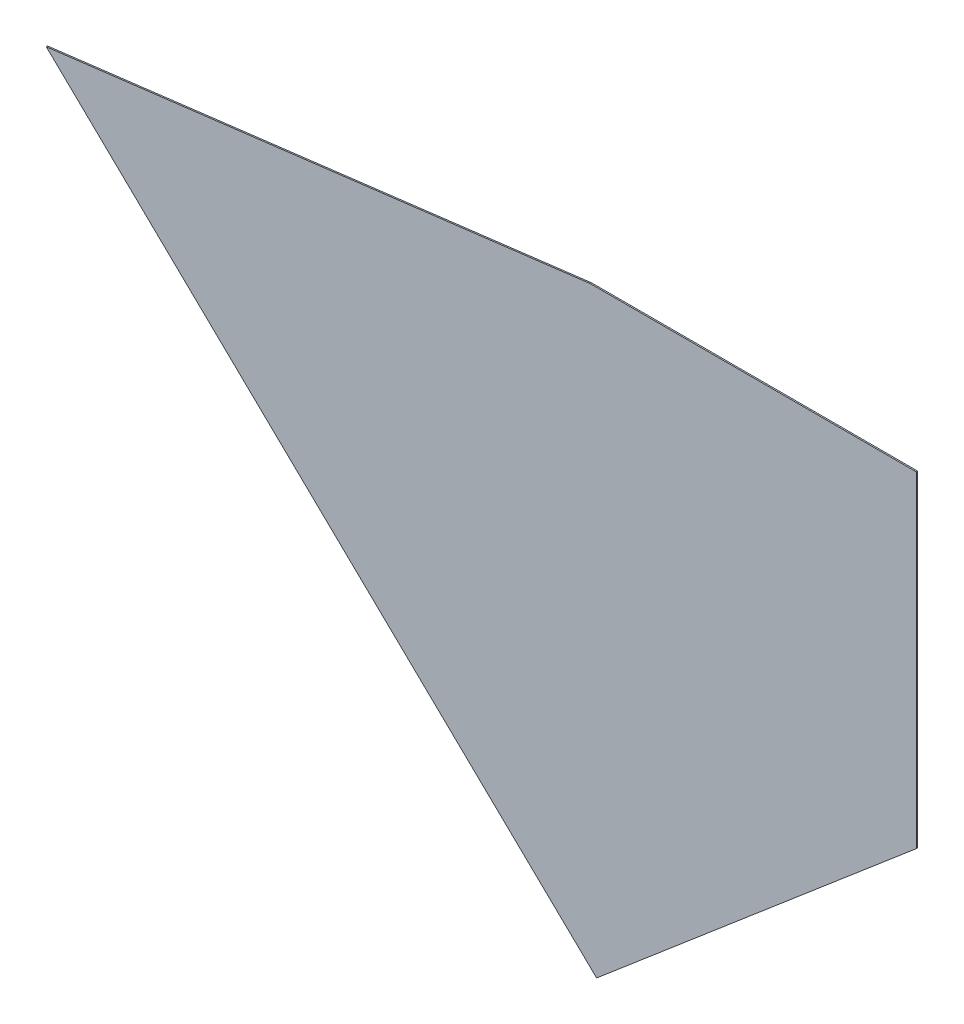
ISO-10303-21;
HEADER;
FILE_DESCRIPTION(('STEP AP214'),'2;1');
FILE_NAME('part.step','',(''),(''),'','','');
FILE_SCHEMA(('AUTOMOTIVE_DESIGN { 1 0 10303 214 1 1 1 1 }'));
ENDSEC;
DATA;
#1=APPLICATION_CONTEXT('core data for automotive mechanical design processes');
#2=APPLICATION_PROTOCOL_DEFINITION('international standard','automotive_design',2000,#1);
#3=PRODUCT_CONTEXT('',#1,'mechanical');
#4=PRODUCT('Part','Part','',(#3));
#5=PRODUCT_RELATED_PRODUCT_CATEGORY('part','',(#4));
#6=PRODUCT_DEFINITION_FORMATION('','',#4);
#7=PRODUCT_DEFINITION_CONTEXT('part definition',#1,'design');
#8=PRODUCT_DEFINITION('design','',#6,#7);
#9=PRODUCT_DEFINITION_SHAPE('','',#8);
#10=(LENGTH_UNIT() NAMED_UNIT(*) SI_UNIT(.MILLI.,.METRE.));
#11=(NAMED_UNIT(*) PLANE_ANGLE_UNIT() SI_UNIT($,.RADIAN.));
#12=(NAMED_UNIT(*) SI_UNIT($,.STERADIAN.) SOLID_ANGLE_UNIT());
#13=UNCERTAINTY_MEASURE_WITH_UNIT(LENGTH_MEASURE(1.E-05),#10,'distance_accuracy_value','');
#14=(GEOMETRIC_REPRESENTATION_CONTEXT(3) GLOBAL_UNCERTAINTY_ASSIGNED_CONTEXT((#13)) GLOBAL_UNIT_ASSIGNED_CONTEXT((#10,
#11,#12)) REPRESENTATION_CONTEXT('',''));
#15=CARTESIAN_POINT('',(0.,0.,0.));
#16=DIRECTION('',(0.,0.,1.));
#17=DIRECTION('',(1.,0.,0.));
#18=AXIS2_PLACEMENT_3D('',#15,#16,#17);
#19=CARTESIAN_POINT('',(-731.52,-2032.,6.35));
#20=DIRECTION('',(-0.647798839714337,0.761811435504061,0.));
#21=DIRECTION('',(-0.761811435504061,-0.647798839714338,0.));
#22=AXIS2_PLACEMENT_3D('',#19,#20,#21);
#23=PLANE('',#22);
#24=DIRECTION('',(0.761811435504061,0.647798839714337,0.));
#25=VECTOR('',#24,1.);
#26=CARTESIAN_POINT('',(-731.52,-2032.,0.));
#27=LINE('',#26,#25);
#28=CARTESIAN_POINT('',(-731.52,-2032.,0.));
#29=VERTEX_POINT('',#28);
#30=CARTESIAN_POINT('',(762.,-762.,0.));
#31=VERTEX_POINT('',#30);
#32=EDGE_CURVE('E107',#29,#31,#27,.T.);
#33=ORIENTED_EDGE('',*,*,#32,.T.);
#34=DIRECTION('',(0.,0.,-1.));
#35=VECTOR('',#34,1.);
#36=CARTESIAN_POINT('',(762.,-762.,6.35));
#37=LINE('',#36,#35);
#38=CARTESIAN_POINT('',(762.,-762.,6.35));
#39=VERTEX_POINT('',#38);
#40=EDGE_CURVE('E11',#39,#31,#37,.T.);
#41=ORIENTED_EDGE('',*,*,#40,.F.);
#42=DIRECTION('',(0.761811435504061,0.647798839714337,0.));
#43=VECTOR('',#42,1.);
#44=CARTESIAN_POINT('',(-731.52,-2032.,6.35));
#45=LINE('',#44,#43);
#46=CARTESIAN_POINT('',(-731.52,-2032.,6.35));
#47=VERTEX_POINT('',#46);
#48=EDGE_CURVE('E115',#47,#39,#45,.T.);
#49=ORIENTED_EDGE('',*,*,#48,.F.);
#50=DIRECTION('',(0.,0.,-1.));
#51=VECTOR('',#50,1.);
#52=CARTESIAN_POINT('',(-731.52,-2032.,6.35));
#53=LINE('',#52,#51);
#54=EDGE_CURVE('E103',#47,#29,#53,.T.);
#55=ORIENTED_EDGE('',*,*,#54,.T.);
#56=EDGE_LOOP('',(#33,#41,#49,#55));
#57=FACE_BOUND('',#56,.T.);
#58=ADVANCED_FACE('F33',(#57),#23,.F.);
#59=CARTESIAN_POINT('',(762.,762.,6.35));
#60=DIRECTION('',(-1.,0.,0.));
#61=DIRECTION('',(0.,-1.,0.));
#62=AXIS2_PLACEMENT_3D('',#59,#60,#61);
#63=PLANE('',#62);
#64=DIRECTION('',(0.,1.,0.));
#65=VECTOR('',#64,1.);
#66=CARTESIAN_POINT('',(762.,762.,0.));
#67=LINE('',#66,#65);
#68=CARTESIAN_POINT('',(762.,762.,0.));
#69=VERTEX_POINT('',#68);
#70=EDGE_CURVE('E110',#31,#69,#67,.T.);
#71=ORIENTED_EDGE('',*,*,#70,.T.);
#72=DIRECTION('',(0.,0.,-1.));
#73=VECTOR('',#72,1.);
#74=CARTESIAN_POINT('',(762.,762.,6.35));
#75=LINE('',#74,#73);
#76=CARTESIAN_POINT('',(762.,762.,6.35));
#77=VERTEX_POINT('',#76);
#78=EDGE_CURVE('E41',#77,#69,#75,.T.);
#79=ORIENTED_EDGE('',*,*,#78,.F.);
#80=DIRECTION('',(0.,1.,0.));
#81=VECTOR('',#80,1.);
#82=CARTESIAN_POINT('',(762.,762.,6.35));
#83=LINE('',#82,#81);
#84=EDGE_CURVE('E83',#39,#77,#83,.T.);
#85=ORIENTED_EDGE('',*,*,#84,.F.);
#86=ORIENTED_EDGE('',*,*,#40,.T.);
#87=EDGE_LOOP('',(#71,#79,#85,#86));
#88=FACE_BOUND('',#87,.T.);
#89=ADVANCED_FACE('F134',(#88),#63,.F.);
#90=CARTESIAN_POINT('',(-762.,762.,6.35));
#91=DIRECTION('',(0.,-1.,0.));
#92=DIRECTION('',(0.,0.,-1.));
#93=AXIS2_PLACEMENT_3D('',#90,#91,#92);
#94=PLANE('',#93);
#95=DIRECTION('',(-1.,0.,0.));
#96=VECTOR('',#95,1.);
#97=CARTESIAN_POINT('',(-762.,762.,0.));
#98=LINE('',#97,#96);
#99=CARTESIAN_POINT('',(-762.,762.,0.));
#100=VERTEX_POINT('',#99);
#101=EDGE_CURVE('E98',#69,#100,#98,.T.);
#102=ORIENTED_EDGE('',*,*,#101,.T.);
#103=DIRECTION('',(0.,0.,-1.));
#104=VECTOR('',#103,1.);
#105=CARTESIAN_POINT('',(-762.,762.,6.35));
#106=LINE('',#105,#104);
#107=CARTESIAN_POINT('',(-762.,762.,6.35));
#108=VERTEX_POINT('',#107);
#109=EDGE_CURVE('E95',#108,#100,#106,.T.);
#110=ORIENTED_EDGE('',*,*,#109,.F.);
#111=DIRECTION('',(-1.,0.,0.));
#112=VECTOR('',#111,1.);
#113=CARTESIAN_POINT('',(-762.,762.,6.35));
#114=LINE('',#113,#112);
#115=EDGE_CURVE('E87',#77,#108,#114,.T.);
#116=ORIENTED_EDGE('',*,*,#115,.F.);
#117=ORIENTED_EDGE('',*,*,#78,.T.);
#118=EDGE_LOOP('',(#102,#110,#116,#117));
#119=FACE_BOUND('',#118,.T.);
#120=ADVANCED_FACE('F96',(#119),#94,.F.);
#121=CARTESIAN_POINT('',(-762.,762.,6.35));
#122=DIRECTION('',(0.122079992532271,-0.992520264490011,0.));
#123=DIRECTION('',(0.992520264490011,0.122079992532271,0.));
#124=AXIS2_PLACEMENT_3D('',#121,#122,#123);
#125=PLANE('',#124);
#126=DIRECTION('',(-0.992520264490011,-0.122079992532271,0.));
#127=VECTOR('',#126,1.);
#128=CARTESIAN_POINT('',(-762.,762.,0.));
#129=LINE('',#128,#127);
#130=CARTESIAN_POINT('',(-3302.,449.579999999999,0.));
#131=VERTEX_POINT('',#130);
#132=EDGE_CURVE('E69',#100,#131,#129,.T.);
#133=ORIENTED_EDGE('',*,*,#132,.T.);
#134=DIRECTION('',(0.,0.,-1.));
#135=VECTOR('',#134,1.);
#136=CARTESIAN_POINT('',(-3302.,449.579999999999,6.35));
#137=LINE('',#136,#135);
#138=CARTESIAN_POINT('',(-3302.,449.579999999999,6.35));
#139=VERTEX_POINT('',#138);
#140=EDGE_CURVE('E99',#139,#131,#137,.T.);
#141=ORIENTED_EDGE('',*,*,#140,.F.);
#142=DIRECTION('',(-0.992520264490011,-0.122079992532271,0.));
#143=VECTOR('',#142,1.);
#144=CARTESIAN_POINT('',(-762.,762.,6.35));
#145=LINE('',#144,#143);
#146=EDGE_CURVE('E91',#108,#139,#145,.T.);
#147=ORIENTED_EDGE('',*,*,#146,.F.);
#148=ORIENTED_EDGE('',*,*,#109,.T.);
#149=EDGE_LOOP('',(#133,#141,#147,#148));
#150=FACE_BOUND('',#149,.T.);
#151=ADVANCED_FACE('F101',(#150),#125,.F.);
#152=CARTESIAN_POINT('',(-3302.,449.579999999999,6.35));
#153=DIRECTION('',(0.694556451843234,0.719438208050515,0.));
#154=DIRECTION('',(-0.719438208050516,0.694556451843234,0.));
#155=AXIS2_PLACEMENT_3D('',#152,#153,#154);
#156=PLANE('',#155);
#157=DIRECTION('',(0.719438208050515,-0.694556451843234,0.));
#158=VECTOR('',#157,1.);
#159=CARTESIAN_POINT('',(-3302.,449.579999999999,0.));
#160=LINE('',#159,#158);
#161=EDGE_CURVE('E75',#131,#29,#160,.T.);
#162=ORIENTED_EDGE('',*,*,#161,.T.);
#163=ORIENTED_EDGE('',*,*,#54,.F.);
#164=DIRECTION('',(0.719438208050515,-0.694556451843234,0.));
#165=VECTOR('',#164,1.);
#166=CARTESIAN_POINT('',(-3302.,449.579999999999,6.35));
#167=LINE('',#166,#165);
#168=EDGE_CURVE('E49',#139,#47,#167,.T.);
#169=ORIENTED_EDGE('',*,*,#168,.F.);
#170=ORIENTED_EDGE('',*,*,#140,.T.);
#171=EDGE_LOOP('',(#162,#163,#169,#170));
#172=FACE_BOUND('',#171,.T.);
#173=ADVANCED_FACE('F123',(#172),#156,.F.);
#174=CARTESIAN_POINT('',(0.,0.,6.35));
#175=DIRECTION('',(0.,0.,-1.));
#176=DIRECTION('',(-1.,0.,0.));
#177=AXIS2_PLACEMENT_3D('',#174,#175,#176);
#178=PLANE('',#177);
#179=ORIENTED_EDGE('',*,*,#48,.T.);
#180=ORIENTED_EDGE('',*,*,#84,.T.);
#181=ORIENTED_EDGE('',*,*,#115,.T.);
#182=ORIENTED_EDGE('',*,*,#146,.T.);
#183=ORIENTED_EDGE('',*,*,#168,.T.);
#184=EDGE_LOOP('',(#179,#180,#181,#182,#183));
#185=FACE_BOUND('',#184,.T.);
#186=ADVANCED_FACE('F89',(#185),#178,.F.);
#187=CARTESIAN_POINT('',(0.,0.,0.));
#188=DIRECTION('',(0.,0.,-1.));
#189=DIRECTION('',(-1.,0.,0.));
#190=AXIS2_PLACEMENT_3D('',#187,#188,#189);
#191=PLANE('',#190);
#192=ORIENTED_EDGE('',*,*,#32,.F.);
#193=ORIENTED_EDGE('',*,*,#161,.F.);
#194=ORIENTED_EDGE('',*,*,#132,.F.);
#195=ORIENTED_EDGE('',*,*,#101,.F.);
#196=ORIENTED_EDGE('',*,*,#70,.F.);
#197=EDGE_LOOP('',(#192,#193,#194,#195,#196));
#198=FACE_BOUND('',#197,.T.);
#199=ADVANCED_FACE('F119',(#198),#191,.T.);
#200=CLOSED_SHELL('',(#58,#89,#120,#151,#173,#186,#199));
#201=MANIFOLD_SOLID_BREP('B2',#200);
#202=ADVANCED_BREP_SHAPE_REPRESENTATION('',(#18,#201),#14);
#203=SHAPE_DEFINITION_REPRESENTATION(#9,#202);
ENDSEC;
END-ISO-10303-21;
